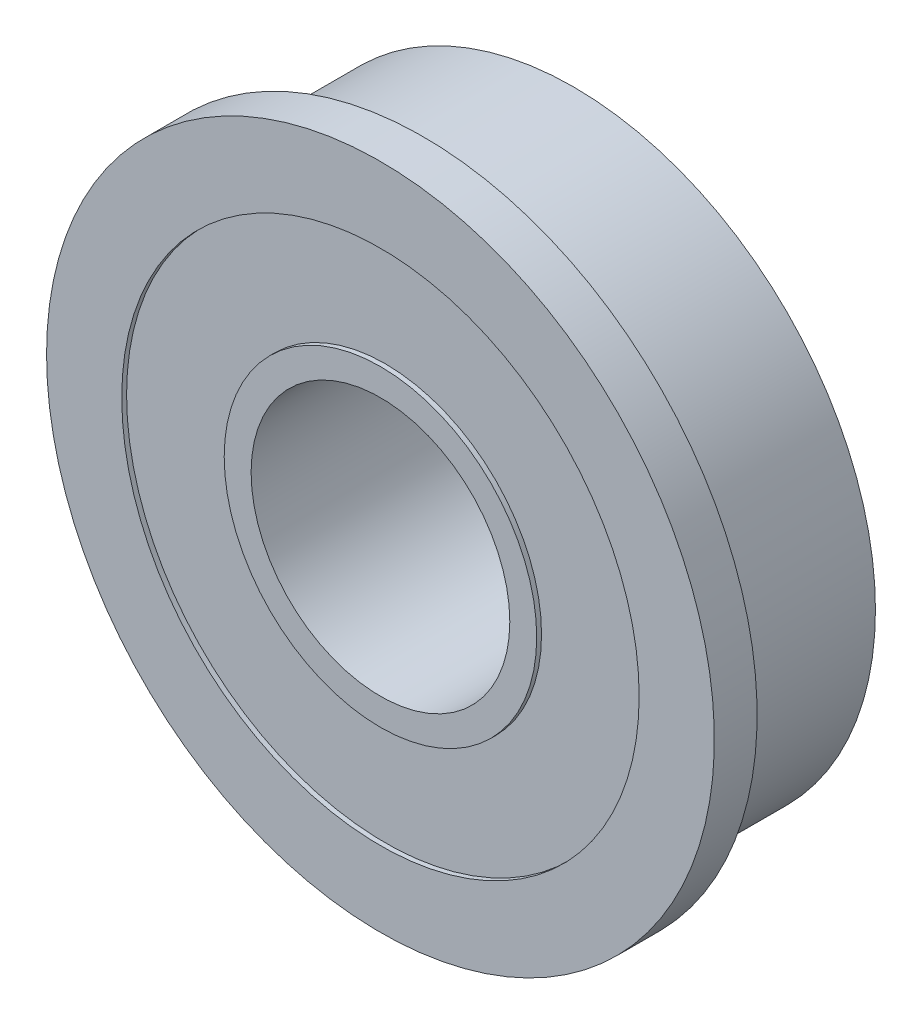
ISO-10303-21;
HEADER;
FILE_DESCRIPTION(('STEP AP214'),'2;1');
FILE_NAME('part.step','',(''),(''),'','','');
FILE_SCHEMA(('AUTOMOTIVE_DESIGN { 1 0 10303 214 1 1 1 1 }'));
ENDSEC;
DATA;
#1=APPLICATION_CONTEXT('core data for automotive mechanical design processes');
#2=APPLICATION_PROTOCOL_DEFINITION('international standard','automotive_design',2000,#1);
#3=PRODUCT_CONTEXT('',#1,'mechanical');
#4=PRODUCT('Part','Part','',(#3));
#5=PRODUCT_RELATED_PRODUCT_CATEGORY('part','',(#4));
#6=PRODUCT_DEFINITION_FORMATION('','',#4);
#7=PRODUCT_DEFINITION_CONTEXT('part definition',#1,'design');
#8=PRODUCT_DEFINITION('design','',#6,#7);
#9=PRODUCT_DEFINITION_SHAPE('','',#8);
#10=(LENGTH_UNIT() NAMED_UNIT(*) SI_UNIT(.MILLI.,.METRE.));
#11=(NAMED_UNIT(*) PLANE_ANGLE_UNIT() SI_UNIT($,.RADIAN.));
#12=(NAMED_UNIT(*) SI_UNIT($,.STERADIAN.) SOLID_ANGLE_UNIT());
#13=UNCERTAINTY_MEASURE_WITH_UNIT(LENGTH_MEASURE(1.E-05),#10,'distance_accuracy_value','');
#14=(GEOMETRIC_REPRESENTATION_CONTEXT(3) GLOBAL_UNCERTAINTY_ASSIGNED_CONTEXT((#13)) GLOBAL_UNIT_ASSIGNED_CONTEXT((#10,
#11,#12)) REPRESENTATION_CONTEXT('',''));
#15=CARTESIAN_POINT('',(0.,0.,0.));
#16=DIRECTION('',(0.,0.,1.));
#17=DIRECTION('',(1.,0.,0.));
#18=AXIS2_PLACEMENT_3D('',#15,#16,#17);
#19=CARTESIAN_POINT('',(0.523009090909089,0.,3.556));
#20=DIRECTION('',(0.,0.,1.));
#21=DIRECTION('',(1.,0.,0.));
#22=AXIS2_PLACEMENT_3D('',#19,#20,#21);
#23=PLANE('',#22);
#24=CARTESIAN_POINT('',(0.,0.,3.556));
#25=DIRECTION('',(0.,0.,1.));
#26=DIRECTION('',(1.,0.,0.));
#27=AXIS2_PLACEMENT_3D('',#24,#25,#26);
#28=CIRCLE('',#27,4.7625);
#29=CARTESIAN_POINT('',(4.7625,0.,3.556));
#30=VERTEX_POINT('',#29);
#31=EDGE_CURVE('E58',#30,#30,#28,.F.);
#32=ORIENTED_EDGE('',*,*,#31,.T.);
#33=EDGE_LOOP('',(#32));
#34=FACE_BOUND('',#33,.T.);
#35=CARTESIAN_POINT('',(0.,0.,3.556));
#36=DIRECTION('',(0.,0.,1.));
#37=DIRECTION('',(1.,0.,0.));
#38=AXIS2_PLACEMENT_3D('',#35,#36,#37);
#39=CIRCLE('',#38,5.7531);
#40=CARTESIAN_POINT('',(5.7531,0.,3.556));
#41=VERTEX_POINT('',#40);
#42=EDGE_CURVE('E18',#41,#41,#39,.F.);
#43=ORIENTED_EDGE('',*,*,#42,.F.);
#44=EDGE_LOOP('',(#43));
#45=FACE_BOUND('',#44,.T.);
#46=ADVANCED_FACE('F15',(#34,#45),#23,.T.);
#47=CARTESIAN_POINT('',(0.,0.,0.));
#48=DIRECTION('',(0.,0.,1.));
#49=DIRECTION('',(1.,0.,0.));
#50=AXIS2_PLACEMENT_3D('',#47,#48,#49);
#51=CYLINDRICAL_SURFACE('',#50,5.7531);
#52=CARTESIAN_POINT('',(0.,0.,3.3782));
#53=DIRECTION('',(0.,0.,1.));
#54=DIRECTION('',(1.,0.,0.));
#55=AXIS2_PLACEMENT_3D('',#52,#53,#54);
#56=CIRCLE('',#55,5.7531);
#57=CARTESIAN_POINT('',(5.7531,0.,3.3782));
#58=VERTEX_POINT('',#57);
#59=EDGE_CURVE('E56',#58,#58,#56,.F.);
#60=ORIENTED_EDGE('',*,*,#59,.F.);
#61=EDGE_LOOP('',(#60));
#62=FACE_BOUND('',#61,.T.);
#63=ORIENTED_EDGE('',*,*,#42,.T.);
#64=EDGE_LOOP('',(#63));
#65=FACE_BOUND('',#64,.T.);
#66=ADVANCED_FACE('F65',(#62,#65),#51,.T.);
#67=CARTESIAN_POINT('',(0.,0.,0.));
#68=DIRECTION('',(0.,0.,1.));
#69=DIRECTION('',(1.,0.,0.));
#70=AXIS2_PLACEMENT_3D('',#67,#68,#69);
#71=CYLINDRICAL_SURFACE('',#70,4.7625);
#72=ORIENTED_EDGE('',*,*,#31,.F.);
#73=EDGE_LOOP('',(#72));
#74=FACE_BOUND('',#73,.T.);
#75=CARTESIAN_POINT('',(0.,0.,-3.556));
#76=DIRECTION('',(0.,0.,1.));
#77=DIRECTION('',(1.,0.,0.));
#78=AXIS2_PLACEMENT_3D('',#75,#76,#77);
#79=CIRCLE('',#78,4.7625);
#80=CARTESIAN_POINT('',(4.7625,0.,-3.556));
#81=VERTEX_POINT('',#80);
#82=EDGE_CURVE('E53',#81,#81,#79,.F.);
#83=ORIENTED_EDGE('',*,*,#82,.T.);
#84=EDGE_LOOP('',(#83));
#85=FACE_BOUND('',#84,.T.);
#86=ADVANCED_FACE('F72',(#74,#85),#71,.F.);
#87=CARTESIAN_POINT('',(0.865909090909089,0.,3.3782));
#88=DIRECTION('',(0.,0.,1.));
#89=DIRECTION('',(1.,0.,0.));
#90=AXIS2_PLACEMENT_3D('',#87,#88,#89);
#91=PLANE('',#90);
#92=ORIENTED_EDGE('',*,*,#59,.T.);
#93=EDGE_LOOP('',(#92));
#94=FACE_BOUND('',#93,.T.);
#95=CARTESIAN_POINT('',(0.,0.,3.3782));
#96=DIRECTION('',(0.,0.,1.));
#97=DIRECTION('',(1.,0.,0.));
#98=AXIS2_PLACEMENT_3D('',#95,#96,#97);
#99=CIRCLE('',#98,9.525);
#100=CARTESIAN_POINT('',(9.525,0.,3.3782));
#101=VERTEX_POINT('',#100);
#102=EDGE_CURVE('E50',#101,#101,#99,.T.);
#103=ORIENTED_EDGE('',*,*,#102,.T.);
#104=EDGE_LOOP('',(#103));
#105=FACE_BOUND('',#104,.T.);
#106=ADVANCED_FACE('F116',(#94,#105),#91,.T.);
#107=CARTESIAN_POINT('',(0.523009090909089,0.,-3.556));
#108=DIRECTION('',(0.,0.,1.));
#109=DIRECTION('',(1.,0.,0.));
#110=AXIS2_PLACEMENT_3D('',#107,#108,#109);
#111=PLANE('',#110);
#112=ORIENTED_EDGE('',*,*,#82,.F.);
#113=EDGE_LOOP('',(#112));
#114=FACE_BOUND('',#113,.T.);
#115=CARTESIAN_POINT('',(0.,0.,-3.556));
#116=DIRECTION('',(0.,0.,1.));
#117=DIRECTION('',(1.,0.,0.));
#118=AXIS2_PLACEMENT_3D('',#115,#116,#117);
#119=CIRCLE('',#118,5.7531);
#120=CARTESIAN_POINT('',(5.7531,0.,-3.556));
#121=VERTEX_POINT('',#120);
#122=EDGE_CURVE('E47',#121,#121,#119,.T.);
#123=ORIENTED_EDGE('',*,*,#122,.F.);
#124=EDGE_LOOP('',(#123));
#125=FACE_BOUND('',#124,.T.);
#126=ADVANCED_FACE('F112',(#114,#125),#111,.F.);
#127=CARTESIAN_POINT('',(0.,0.,0.));
#128=DIRECTION('',(0.,0.,1.));
#129=DIRECTION('',(1.,0.,0.));
#130=AXIS2_PLACEMENT_3D('',#127,#128,#129);
#131=CYLINDRICAL_SURFACE('',#130,9.525);
#132=ORIENTED_EDGE('',*,*,#102,.F.);
#133=EDGE_LOOP('',(#132));
#134=FACE_BOUND('',#133,.T.);
#135=CARTESIAN_POINT('',(0.,0.,3.556));
#136=DIRECTION('',(0.,0.,1.));
#137=DIRECTION('',(1.,0.,0.));
#138=AXIS2_PLACEMENT_3D('',#135,#136,#137);
#139=CIRCLE('',#138,9.525);
#140=CARTESIAN_POINT('',(9.525,0.,3.556));
#141=VERTEX_POINT('',#140);
#142=EDGE_CURVE('E44',#141,#141,#139,.F.);
#143=ORIENTED_EDGE('',*,*,#142,.F.);
#144=EDGE_LOOP('',(#143));
#145=FACE_BOUND('',#144,.T.);
#146=ADVANCED_FACE('F108',(#134,#145),#131,.F.);
#147=CARTESIAN_POINT('',(0.,0.,0.));
#148=DIRECTION('',(0.,0.,1.));
#149=DIRECTION('',(1.,0.,0.));
#150=AXIS2_PLACEMENT_3D('',#147,#148,#149);
#151=CYLINDRICAL_SURFACE('',#150,5.7531);
#152=ORIENTED_EDGE('',*,*,#122,.T.);
#153=EDGE_LOOP('',(#152));
#154=FACE_BOUND('',#153,.T.);
#155=CARTESIAN_POINT('',(0.,0.,-3.3782));
#156=DIRECTION('',(0.,0.,1.));
#157=DIRECTION('',(1.,0.,0.));
#158=AXIS2_PLACEMENT_3D('',#155,#156,#157);
#159=CIRCLE('',#158,5.7531);
#160=CARTESIAN_POINT('',(5.7531,0.,-3.3782));
#161=VERTEX_POINT('',#160);
#162=EDGE_CURVE('E41',#161,#161,#159,.F.);
#163=ORIENTED_EDGE('',*,*,#162,.T.);
#164=EDGE_LOOP('',(#163));
#165=FACE_BOUND('',#164,.T.);
#166=ADVANCED_FACE('F104',(#154,#165),#151,.T.);
#167=CARTESIAN_POINT('',(1.01022727272727,0.,3.556));
#168=DIRECTION('',(0.,0.,1.));
#169=DIRECTION('',(1.,0.,0.));
#170=AXIS2_PLACEMENT_3D('',#167,#168,#169);
#171=PLANE('',#170);
#172=ORIENTED_EDGE('',*,*,#142,.T.);
#173=EDGE_LOOP('',(#172));
#174=FACE_BOUND('',#173,.T.);
#175=CARTESIAN_POINT('',(0.,0.,3.556));
#176=DIRECTION('',(0.,0.,-1.));
#177=DIRECTION('',(-1.,0.,0.));
#178=AXIS2_PLACEMENT_3D('',#175,#176,#177);
#179=CIRCLE('',#178,12.2936);
#180=CARTESIAN_POINT('',(-12.2936,0.,3.556));
#181=VERTEX_POINT('',#180);
#182=EDGE_CURVE('E38',#181,#181,#179,.T.);
#183=ORIENTED_EDGE('',*,*,#182,.F.);
#184=EDGE_LOOP('',(#183));
#185=FACE_BOUND('',#184,.T.);
#186=ADVANCED_FACE('F100',(#174,#185),#171,.T.);
#187=CARTESIAN_POINT('',(0.865909090909089,0.,-3.3782));
#188=DIRECTION('',(0.,0.,1.));
#189=DIRECTION('',(1.,0.,0.));
#190=AXIS2_PLACEMENT_3D('',#187,#188,#189);
#191=PLANE('',#190);
#192=ORIENTED_EDGE('',*,*,#162,.F.);
#193=EDGE_LOOP('',(#192));
#194=FACE_BOUND('',#193,.T.);
#195=CARTESIAN_POINT('',(0.,0.,-3.3782));
#196=DIRECTION('',(0.,0.,1.));
#197=DIRECTION('',(1.,0.,0.));
#198=AXIS2_PLACEMENT_3D('',#195,#196,#197);
#199=CIRCLE('',#198,9.525);
#200=CARTESIAN_POINT('',(9.525,0.,-3.3782));
#201=VERTEX_POINT('',#200);
#202=EDGE_CURVE('E35',#201,#201,#199,.F.);
#203=ORIENTED_EDGE('',*,*,#202,.T.);
#204=EDGE_LOOP('',(#203));
#205=FACE_BOUND('',#204,.T.);
#206=ADVANCED_FACE('F96',(#194,#205),#191,.F.);
#207=CARTESIAN_POINT('',(0.,0.,3.556));
#208=DIRECTION('',(0.,0.,-1.));
#209=DIRECTION('',(-1.,0.,0.));
#210=AXIS2_PLACEMENT_3D('',#207,#208,#209);
#211=CYLINDRICAL_SURFACE('',#210,12.2936);
#212=ORIENTED_EDGE('',*,*,#182,.T.);
#213=EDGE_LOOP('',(#212));
#214=FACE_BOUND('',#213,.T.);
#215=CARTESIAN_POINT('',(0.,0.,1.9812));
#216=DIRECTION('',(0.,0.,-1.));
#217=DIRECTION('',(-1.,0.,0.));
#218=AXIS2_PLACEMENT_3D('',#215,#216,#217);
#219=CIRCLE('',#218,12.2936);
#220=CARTESIAN_POINT('',(-12.2936,0.,1.9812));
#221=VERTEX_POINT('',#220);
#222=EDGE_CURVE('E32',#221,#221,#219,.F.);
#223=ORIENTED_EDGE('',*,*,#222,.T.);
#224=EDGE_LOOP('',(#223));
#225=FACE_BOUND('',#224,.T.);
#226=ADVANCED_FACE('F92',(#214,#225),#211,.T.);
#227=CARTESIAN_POINT('',(0.,0.,0.));
#228=DIRECTION('',(0.,0.,1.));
#229=DIRECTION('',(1.,0.,0.));
#230=AXIS2_PLACEMENT_3D('',#227,#228,#229);
#231=CYLINDRICAL_SURFACE('',#230,9.525);
#232=ORIENTED_EDGE('',*,*,#202,.F.);
#233=EDGE_LOOP('',(#232));
#234=FACE_BOUND('',#233,.T.);
#235=CARTESIAN_POINT('',(0.,0.,-3.556));
#236=DIRECTION('',(0.,0.,1.));
#237=DIRECTION('',(1.,0.,0.));
#238=AXIS2_PLACEMENT_3D('',#235,#236,#237);
#239=CIRCLE('',#238,9.525);
#240=CARTESIAN_POINT('',(9.525,0.,-3.556));
#241=VERTEX_POINT('',#240);
#242=EDGE_CURVE('E27',#241,#241,#239,.F.);
#243=ORIENTED_EDGE('',*,*,#242,.T.);
#244=EDGE_LOOP('',(#243));
#245=FACE_BOUND('',#244,.T.);
#246=ADVANCED_FACE('F88',(#234,#245),#231,.F.);
#247=CARTESIAN_POINT('',(1.1176,0.,1.9812));
#248=DIRECTION('',(0.,0.,1.));
#249=DIRECTION('',(1.,0.,0.));
#250=AXIS2_PLACEMENT_3D('',#247,#248,#249);
#251=PLANE('',#250);
#252=CARTESIAN_POINT('',(0.,0.,1.9812));
#253=DIRECTION('',(0.,0.,1.));
#254=DIRECTION('',(1.,0.,0.));
#255=AXIS2_PLACEMENT_3D('',#252,#253,#254);
#256=CIRCLE('',#255,11.1125);
#257=CARTESIAN_POINT('',(11.1125,0.,1.9812));
#258=VERTEX_POINT('',#257);
#259=EDGE_CURVE('E22',#258,#258,#256,.F.);
#260=ORIENTED_EDGE('',*,*,#259,.F.);
#261=EDGE_LOOP('',(#260));
#262=FACE_BOUND('',#261,.T.);
#263=ORIENTED_EDGE('',*,*,#222,.F.);
#264=EDGE_LOOP('',(#263));
#265=FACE_BOUND('',#264,.T.);
#266=ADVANCED_FACE('F81',(#262,#265),#251,.F.);
#267=CARTESIAN_POINT('',(1.01022727272727,0.,-3.556));
#268=DIRECTION('',(0.,0.,1.));
#269=DIRECTION('',(1.,0.,0.));
#270=AXIS2_PLACEMENT_3D('',#267,#268,#269);
#271=PLANE('',#270);
#272=ORIENTED_EDGE('',*,*,#242,.F.);
#273=EDGE_LOOP('',(#272));
#274=FACE_BOUND('',#273,.T.);
#275=CARTESIAN_POINT('',(0.,0.,-3.556));
#276=DIRECTION('',(0.,0.,1.));
#277=DIRECTION('',(1.,0.,0.));
#278=AXIS2_PLACEMENT_3D('',#275,#276,#277);
#279=CIRCLE('',#278,11.1125);
#280=CARTESIAN_POINT('',(11.1125,0.,-3.556));
#281=VERTEX_POINT('',#280);
#282=EDGE_CURVE('E10',#281,#281,#279,.T.);
#283=ORIENTED_EDGE('',*,*,#282,.F.);
#284=EDGE_LOOP('',(#283));
#285=FACE_BOUND('',#284,.T.);
#286=ADVANCED_FACE('F76',(#274,#285),#271,.F.);
#287=CARTESIAN_POINT('',(0.,0.,0.));
#288=DIRECTION('',(0.,0.,1.));
#289=DIRECTION('',(1.,0.,0.));
#290=AXIS2_PLACEMENT_3D('',#287,#288,#289);
#291=CYLINDRICAL_SURFACE('',#290,11.1125);
#292=ORIENTED_EDGE('',*,*,#282,.T.);
#293=EDGE_LOOP('',(#292));
#294=FACE_BOUND('',#293,.T.);
#295=ORIENTED_EDGE('',*,*,#259,.T.);
#296=EDGE_LOOP('',(#295));
#297=FACE_BOUND('',#296,.T.);
#298=ADVANCED_FACE('F74',(#294,#297),#291,.T.);
#299=CLOSED_SHELL('',(#46,#66,#86,#106,#126,#146,#166,#186,#206,#226,#246,#266,#286,#298));
#300=MANIFOLD_SOLID_BREP('B1',#299);
#301=ADVANCED_BREP_SHAPE_REPRESENTATION('',(#18,#300),#14);
#302=SHAPE_DEFINITION_REPRESENTATION(#9,#301);
ENDSEC;
END-ISO-10303-21;
